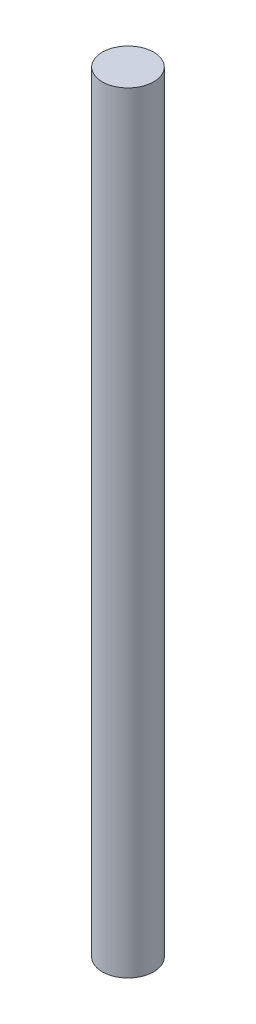
ISO-10303-21;
HEADER;
FILE_DESCRIPTION(('STEP AP214'),'2;1');
FILE_NAME('part.step','',(''),(''),'','','');
FILE_SCHEMA(('AUTOMOTIVE_DESIGN { 1 0 10303 214 1 1 1 1 }'));
ENDSEC;
DATA;
#1=APPLICATION_CONTEXT('core data for automotive mechanical design processes');
#2=APPLICATION_PROTOCOL_DEFINITION('international standard','automotive_design',2000,#1);
#3=PRODUCT_CONTEXT('',#1,'mechanical');
#4=PRODUCT('Part','Part','',(#3));
#5=PRODUCT_RELATED_PRODUCT_CATEGORY('part','',(#4));
#6=PRODUCT_DEFINITION_FORMATION('','',#4);
#7=PRODUCT_DEFINITION_CONTEXT('part definition',#1,'design');
#8=PRODUCT_DEFINITION('design','',#6,#7);
#9=PRODUCT_DEFINITION_SHAPE('','',#8);
#10=(LENGTH_UNIT() NAMED_UNIT(*) SI_UNIT(.MILLI.,.METRE.));
#11=(NAMED_UNIT(*) PLANE_ANGLE_UNIT() SI_UNIT($,.RADIAN.));
#12=(NAMED_UNIT(*) SI_UNIT($,.STERADIAN.) SOLID_ANGLE_UNIT());
#13=UNCERTAINTY_MEASURE_WITH_UNIT(LENGTH_MEASURE(1.E-05),#10,'distance_accuracy_value','');
#14=(GEOMETRIC_REPRESENTATION_CONTEXT(3) GLOBAL_UNCERTAINTY_ASSIGNED_CONTEXT((#13)) GLOBAL_UNIT_ASSIGNED_CONTEXT((#10,
#11,#12)) REPRESENTATION_CONTEXT('',''));
#15=CARTESIAN_POINT('',(0.,0.,0.));
#16=DIRECTION('',(0.,0.,1.));
#17=DIRECTION('',(1.,0.,0.));
#18=AXIS2_PLACEMENT_3D('',#15,#16,#17);
#19=CARTESIAN_POINT('',(0.,-1500.,0.));
#20=DIRECTION('',(0.,1.,0.));
#21=DIRECTION('',(0.,0.,1.));
#22=AXIS2_PLACEMENT_3D('',#19,#20,#21);
#23=CYLINDRICAL_SURFACE('',#22,50.);
#24=CARTESIAN_POINT('',(0.,-1500.,0.));
#25=DIRECTION('',(0.,1.,0.));
#26=DIRECTION('',(0.,0.,1.));
#27=AXIS2_PLACEMENT_3D('',#24,#25,#26);
#28=CIRCLE('',#27,50.);
#29=CARTESIAN_POINT('',(0.,-1500.,50.));
#30=VERTEX_POINT('',#29);
#31=EDGE_CURVE('E10',#30,#30,#28,.T.);
#32=ORIENTED_EDGE('',*,*,#31,.T.);
#33=EDGE_LOOP('',(#32));
#34=FACE_BOUND('',#33,.T.);
#35=CARTESIAN_POINT('',(0.,0.,0.));
#36=DIRECTION('',(0.,1.,0.));
#37=DIRECTION('',(0.,0.,1.));
#38=AXIS2_PLACEMENT_3D('',#35,#36,#37);
#39=CIRCLE('',#38,50.);
#40=CARTESIAN_POINT('',(0.,0.,50.));
#41=VERTEX_POINT('',#40);
#42=EDGE_CURVE('E36',#41,#41,#39,.T.);
#43=ORIENTED_EDGE('',*,*,#42,.F.);
#44=EDGE_LOOP('',(#43));
#45=FACE_BOUND('',#44,.T.);
#46=ADVANCED_FACE('F33',(#34,#45),#23,.T.);
#47=CARTESIAN_POINT('',(0.,-1500.,0.));
#48=DIRECTION('',(0.,1.,0.));
#49=DIRECTION('',(0.,0.,1.));
#50=AXIS2_PLACEMENT_3D('',#47,#48,#49);
#51=PLANE('',#50);
#52=ORIENTED_EDGE('',*,*,#31,.F.);
#53=EDGE_LOOP('',(#52));
#54=FACE_BOUND('',#53,.T.);
#55=ADVANCED_FACE('F48',(#54),#51,.F.);
#56=CARTESIAN_POINT('',(0.,0.,0.));
#57=DIRECTION('',(0.,1.,0.));
#58=DIRECTION('',(0.,0.,1.));
#59=AXIS2_PLACEMENT_3D('',#56,#57,#58);
#60=PLANE('',#59);
#61=ORIENTED_EDGE('',*,*,#42,.T.);
#62=EDGE_LOOP('',(#61));
#63=FACE_BOUND('',#62,.T.);
#64=ADVANCED_FACE('F45',(#63),#60,.T.);
#65=CLOSED_SHELL('',(#46,#55,#64));
#66=MANIFOLD_SOLID_BREP('B2',#65);
#67=ADVANCED_BREP_SHAPE_REPRESENTATION('',(#18,#66),#14);
#68=SHAPE_DEFINITION_REPRESENTATION(#9,#67);
ENDSEC;
END-ISO-10303-21;
